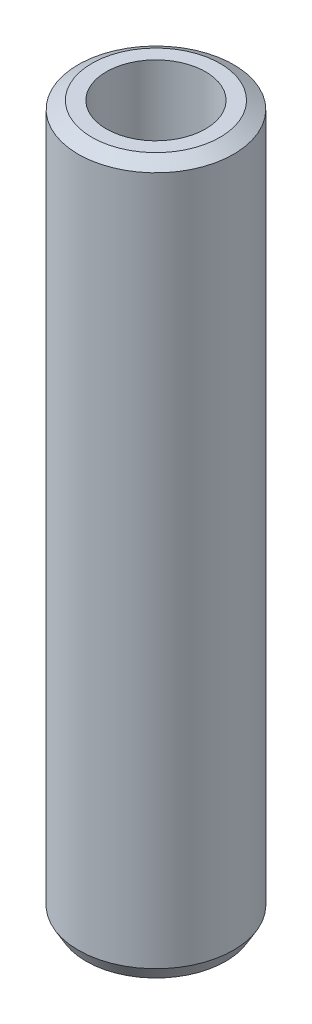
ISO-10303-21;
HEADER;
FILE_DESCRIPTION(('STEP AP214'),'2;1');
FILE_NAME('part.step','',(''),(''),'','','');
FILE_SCHEMA(('AUTOMOTIVE_DESIGN { 1 0 10303 214 1 1 1 1 }'));
ENDSEC;
DATA;
#1=APPLICATION_CONTEXT('core data for automotive mechanical design processes');
#2=APPLICATION_PROTOCOL_DEFINITION('international standard','automotive_design',2000,#1);
#3=PRODUCT_CONTEXT('',#1,'mechanical');
#4=PRODUCT('Part','Part','',(#3));
#5=PRODUCT_RELATED_PRODUCT_CATEGORY('part','',(#4));
#6=PRODUCT_DEFINITION_FORMATION('','',#4);
#7=PRODUCT_DEFINITION_CONTEXT('part definition',#1,'design');
#8=PRODUCT_DEFINITION('design','',#6,#7);
#9=PRODUCT_DEFINITION_SHAPE('','',#8);
#10=(LENGTH_UNIT() NAMED_UNIT(*) SI_UNIT(.MILLI.,.METRE.));
#11=(NAMED_UNIT(*) PLANE_ANGLE_UNIT() SI_UNIT($,.RADIAN.));
#12=(NAMED_UNIT(*) SI_UNIT($,.STERADIAN.) SOLID_ANGLE_UNIT());
#13=UNCERTAINTY_MEASURE_WITH_UNIT(LENGTH_MEASURE(1.E-05),#10,'distance_accuracy_value','');
#14=(GEOMETRIC_REPRESENTATION_CONTEXT(3) GLOBAL_UNCERTAINTY_ASSIGNED_CONTEXT((#13)) GLOBAL_UNIT_ASSIGNED_CONTEXT((#10,
#11,#12)) REPRESENTATION_CONTEXT('',''));
#15=CARTESIAN_POINT('',(0.,0.,0.));
#16=DIRECTION('',(0.,0.,1.));
#17=DIRECTION('',(1.,0.,0.));
#18=AXIS2_PLACEMENT_3D('',#15,#16,#17);
#19=CARTESIAN_POINT('',(0.,480.348760064337,0.));
#20=DIRECTION('',(0.,-1.,0.));
#21=DIRECTION('',(0.,0.,-1.));
#22=AXIS2_PLACEMENT_3D('',#19,#20,#21);
#23=CYLINDRICAL_SURFACE('',#22,52.5);
#24=CARTESIAN_POINT('',(0.,475.036694775682,0.));
#25=DIRECTION('',(0.,1.,0.));
#26=DIRECTION('',(0.,0.,1.));
#27=AXIS2_PLACEMENT_3D('',#24,#25,#26);
#28=CIRCLE('',#27,52.5);
#29=CARTESIAN_POINT('',(0.,475.036694775682,52.5));
#30=VERTEX_POINT('',#29);
#31=EDGE_CURVE('E50',#30,#30,#28,.F.);
#32=ORIENTED_EDGE('',*,*,#31,.T.);
#33=EDGE_LOOP('',(#32));
#34=FACE_BOUND('',#33,.T.);
#35=CARTESIAN_POINT('',(0.,9.20076697307481,0.));
#36=DIRECTION('',(0.,1.,0.));
#37=DIRECTION('',(0.,0.,1.));
#38=AXIS2_PLACEMENT_3D('',#35,#36,#37);
#39=CIRCLE('',#38,52.5);
#40=CARTESIAN_POINT('',(0.,9.20076697307481,52.5));
#41=VERTEX_POINT('',#40);
#42=EDGE_CURVE('E51',#41,#41,#39,.T.);
#43=ORIENTED_EDGE('',*,*,#42,.T.);
#44=EDGE_LOOP('',(#43));
#45=FACE_BOUND('',#44,.T.);
#46=ADVANCED_FACE('F39',(#34,#45),#23,.T.);
#47=CARTESIAN_POINT('',(0.,480.348760064337,0.));
#48=DIRECTION('',(0.,1.,0.));
#49=DIRECTION('',(0.,0.,1.));
#50=AXIS2_PLACEMENT_3D('',#47,#48,#49);
#51=PLANE('',#50);
#52=CARTESIAN_POINT('',(0.,480.348760064337,0.));
#53=DIRECTION('',(0.,1.,0.));
#54=DIRECTION('',(0.,0.,1.));
#55=AXIS2_PLACEMENT_3D('',#52,#53,#54);
#56=CIRCLE('',#55,43.2992330269252);
#57=CARTESIAN_POINT('',(0.,480.348760064337,43.2992330269252));
#58=VERTEX_POINT('',#57);
#59=EDGE_CURVE('E54',#58,#58,#56,.T.);
#60=ORIENTED_EDGE('',*,*,#59,.T.);
#61=EDGE_LOOP('',(#60));
#62=FACE_BOUND('',#61,.T.);
#63=CARTESIAN_POINT('',(0.,480.348760064337,0.));
#64=DIRECTION('',(0.,1.,0.));
#65=DIRECTION('',(0.,0.,1.));
#66=AXIS2_PLACEMENT_3D('',#63,#64,#65);
#67=CIRCLE('',#66,33.5166714507765);
#68=CARTESIAN_POINT('',(0.,480.348760064337,33.5166714507765));
#69=VERTEX_POINT('',#68);
#70=EDGE_CURVE('E58',#69,#69,#67,.T.);
#71=ORIENTED_EDGE('',*,*,#70,.F.);
#72=EDGE_LOOP('',(#71));
#73=FACE_BOUND('',#72,.T.);
#74=ADVANCED_FACE('F69',(#62,#73),#51,.T.);
#75=CARTESIAN_POINT('',(0.,0.,0.));
#76=DIRECTION('',(0.,1.,0.));
#77=DIRECTION('',(0.,0.,1.));
#78=AXIS2_PLACEMENT_3D('',#75,#76,#77);
#79=PLANE('',#78);
#80=CARTESIAN_POINT('',(0.,0.,0.));
#81=DIRECTION('',(0.,1.,0.));
#82=DIRECTION('',(0.,0.,1.));
#83=AXIS2_PLACEMENT_3D('',#80,#81,#82);
#84=CIRCLE('',#83,47.1879347113442);
#85=CARTESIAN_POINT('',(0.,0.,47.1879347113442));
#86=VERTEX_POINT('',#85);
#87=EDGE_CURVE('E10',#86,#86,#84,.F.);
#88=ORIENTED_EDGE('',*,*,#87,.T.);
#89=EDGE_LOOP('',(#88));
#90=FACE_BOUND('',#89,.T.);
#91=CARTESIAN_POINT('',(0.,0.,0.));
#92=DIRECTION('',(0.,1.,0.));
#93=DIRECTION('',(0.,0.,1.));
#94=AXIS2_PLACEMENT_3D('',#91,#92,#93);
#95=CIRCLE('',#94,33.5166714507765);
#96=CARTESIAN_POINT('',(0.,0.,33.5166714507765));
#97=VERTEX_POINT('',#96);
#98=EDGE_CURVE('E63',#97,#97,#95,.T.);
#99=ORIENTED_EDGE('',*,*,#98,.T.);
#100=EDGE_LOOP('',(#99));
#101=FACE_BOUND('',#100,.T.);
#102=ADVANCED_FACE('F75',(#90,#101),#79,.F.);
#103=CARTESIAN_POINT('',(0.,480.348760064337,0.));
#104=DIRECTION('',(0.,-1.,0.));
#105=DIRECTION('',(0.,0.,-1.));
#106=AXIS2_PLACEMENT_3D('',#103,#104,#105);
#107=CYLINDRICAL_SURFACE('',#106,33.5166714507765);
#108=ORIENTED_EDGE('',*,*,#70,.T.);
#109=EDGE_LOOP('',(#108));
#110=FACE_BOUND('',#109,.T.);
#111=ORIENTED_EDGE('',*,*,#98,.F.);
#112=EDGE_LOOP('',(#111));
#113=FACE_BOUND('',#112,.T.);
#114=ADVANCED_FACE('F70',(#110,#113),#107,.F.);
#115=CARTESIAN_POINT('',(0.,480.348760064337,0.));
#116=DIRECTION('',(0.,-1.,0.));
#117=DIRECTION('',(0.,0.,-1.));
#118=AXIS2_PLACEMENT_3D('',#115,#116,#117);
#119=CONICAL_SURFACE('',#118,43.2992330269252,1.0471975511966);
#120=ORIENTED_EDGE('',*,*,#31,.F.);
#121=EDGE_LOOP('',(#120));
#122=FACE_BOUND('',#121,.T.);
#123=ORIENTED_EDGE('',*,*,#59,.F.);
#124=EDGE_LOOP('',(#123));
#125=FACE_BOUND('',#124,.T.);
#126=ADVANCED_FACE('F81',(#122,#125),#119,.T.);
#127=CARTESIAN_POINT('',(0.,9.20076697307481,0.));
#128=DIRECTION('',(0.,1.,0.));
#129=DIRECTION('',(0.,0.,1.));
#130=AXIS2_PLACEMENT_3D('',#127,#128,#129);
#131=CONICAL_SURFACE('',#130,52.5,0.523598775598305);
#132=ORIENTED_EDGE('',*,*,#87,.F.);
#133=EDGE_LOOP('',(#132));
#134=FACE_BOUND('',#133,.T.);
#135=ORIENTED_EDGE('',*,*,#42,.F.);
#136=EDGE_LOOP('',(#135));
#137=FACE_BOUND('',#136,.T.);
#138=ADVANCED_FACE('F45',(#134,#137),#131,.T.);
#139=CLOSED_SHELL('',(#46,#74,#102,#114,#126,#138));
#140=MANIFOLD_SOLID_BREP('B2',#139);
#141=ADVANCED_BREP_SHAPE_REPRESENTATION('',(#18,#140),#14);
#142=SHAPE_DEFINITION_REPRESENTATION(#9,#141);
ENDSEC;
END-ISO-10303-21;
